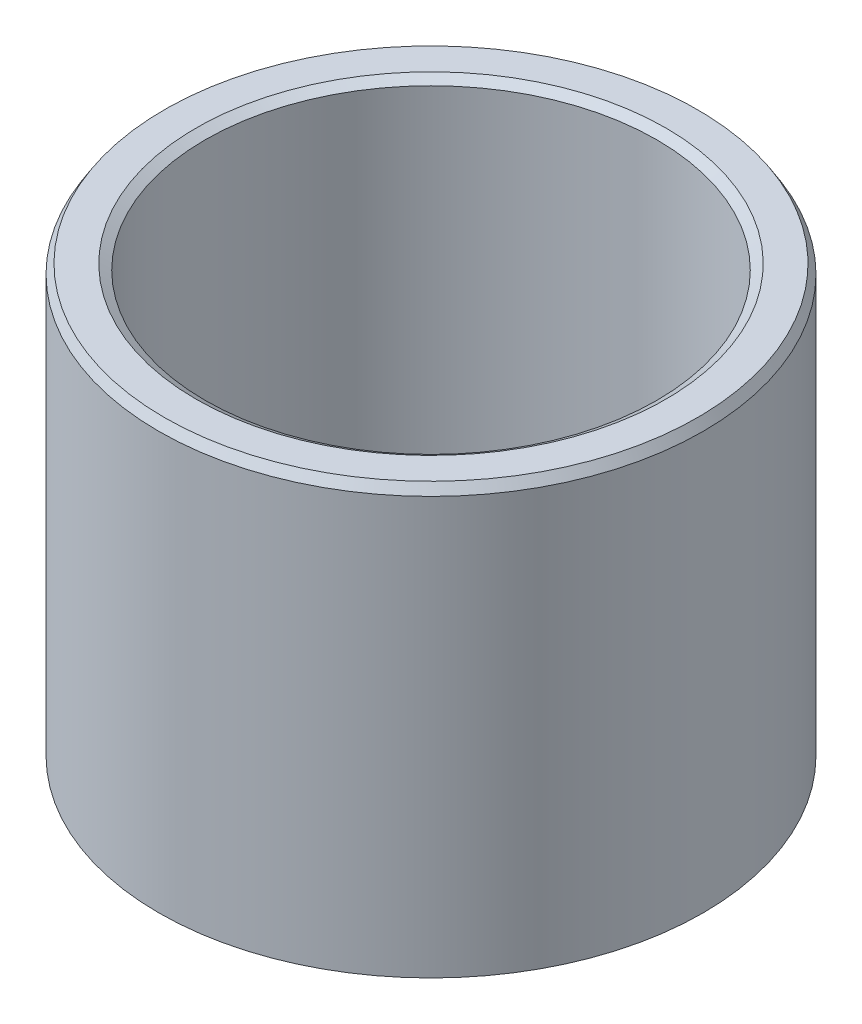
ISO-10303-21;
HEADER;
FILE_DESCRIPTION(('STEP AP214'),'2;1');
FILE_NAME('part.step','',(''),(''),'','','');
FILE_SCHEMA(('AUTOMOTIVE_DESIGN { 1 0 10303 214 1 1 1 1 }'));
ENDSEC;
DATA;
#1=APPLICATION_CONTEXT('core data for automotive mechanical design processes');
#2=APPLICATION_PROTOCOL_DEFINITION('international standard','automotive_design',2000,#1);
#3=PRODUCT_CONTEXT('',#1,'mechanical');
#4=PRODUCT('Part','Part','',(#3));
#5=PRODUCT_RELATED_PRODUCT_CATEGORY('part','',(#4));
#6=PRODUCT_DEFINITION_FORMATION('','',#4);
#7=PRODUCT_DEFINITION_CONTEXT('part definition',#1,'design');
#8=PRODUCT_DEFINITION('design','',#6,#7);
#9=PRODUCT_DEFINITION_SHAPE('','',#8);
#10=(LENGTH_UNIT() NAMED_UNIT(*) SI_UNIT(.MILLI.,.METRE.));
#11=(NAMED_UNIT(*) PLANE_ANGLE_UNIT() SI_UNIT($,.RADIAN.));
#12=(NAMED_UNIT(*) SI_UNIT($,.STERADIAN.) SOLID_ANGLE_UNIT());
#13=UNCERTAINTY_MEASURE_WITH_UNIT(LENGTH_MEASURE(1.E-05),#10,'distance_accuracy_value','');
#14=(GEOMETRIC_REPRESENTATION_CONTEXT(3) GLOBAL_UNCERTAINTY_ASSIGNED_CONTEXT((#13)) GLOBAL_UNIT_ASSIGNED_CONTEXT((#10,
#11,#12)) REPRESENTATION_CONTEXT('',''));
#15=CARTESIAN_POINT('',(0.,0.,0.));
#16=DIRECTION('',(0.,0.,1.));
#17=DIRECTION('',(1.,0.,0.));
#18=AXIS2_PLACEMENT_3D('',#15,#16,#17);
#19=CARTESIAN_POINT('',(0.,47.5842711283165,0.));
#20=DIRECTION('',(0.,-1.,0.));
#21=DIRECTION('',(0.,0.,-1.));
#22=AXIS2_PLACEMENT_3D('',#19,#20,#21);
#23=CYLINDRICAL_SURFACE('',#22,30.);
#24=CARTESIAN_POINT('',(0.,0.618793119774128,0.));
#25=DIRECTION('',(0.,1.,0.));
#26=DIRECTION('',(0.,0.,1.));
#27=AXIS2_PLACEMENT_3D('',#24,#25,#26);
#28=CIRCLE('',#27,30.);
#29=CARTESIAN_POINT('',(0.,0.618793119774128,30.));
#30=VERTEX_POINT('',#29);
#31=EDGE_CURVE('E10',#30,#30,#28,.T.);
#32=ORIENTED_EDGE('',*,*,#31,.T.);
#33=EDGE_LOOP('',(#32));
#34=FACE_BOUND('',#33,.T.);
#35=CARTESIAN_POINT('',(0.,46.57749135171,0.));
#36=DIRECTION('',(0.,1.,0.));
#37=DIRECTION('',(0.,0.,1.));
#38=AXIS2_PLACEMENT_3D('',#35,#36,#37);
#39=CIRCLE('',#38,30.);
#40=CARTESIAN_POINT('',(0.,46.57749135171,30.));
#41=VERTEX_POINT('',#40);
#42=EDGE_CURVE('E50',#41,#41,#39,.F.);
#43=ORIENTED_EDGE('',*,*,#42,.T.);
#44=EDGE_LOOP('',(#43));
#45=FACE_BOUND('',#44,.T.);
#46=ADVANCED_FACE('F39',(#34,#45),#23,.T.);
#47=CARTESIAN_POINT('',(0.,47.5842711283165,0.));
#48=DIRECTION('',(0.,1.,0.));
#49=DIRECTION('',(0.,0.,1.));
#50=AXIS2_PLACEMENT_3D('',#47,#48,#49);
#51=PLANE('',#50);
#52=CARTESIAN_POINT('',(0.,47.5842711283165,0.));
#53=DIRECTION('',(0.,1.,0.));
#54=DIRECTION('',(0.,0.,1.));
#55=AXIS2_PLACEMENT_3D('',#52,#53,#54);
#56=CIRCLE('',#55,25.8882689231475);
#57=CARTESIAN_POINT('',(0.,47.5842711283165,25.8882689231475));
#58=VERTEX_POINT('',#57);
#59=EDGE_CURVE('E58',#58,#58,#56,.F.);
#60=ORIENTED_EDGE('',*,*,#59,.T.);
#61=EDGE_LOOP('',(#60));
#62=FACE_BOUND('',#61,.T.);
#63=CARTESIAN_POINT('',(0.,47.5842711283165,0.));
#64=DIRECTION('',(0.,1.,0.));
#65=DIRECTION('',(0.,0.,1.));
#66=AXIS2_PLACEMENT_3D('',#63,#64,#65);
#67=CIRCLE('',#66,29.3812068802259);
#68=CARTESIAN_POINT('',(0.,47.5842711283165,29.3812068802259));
#69=VERTEX_POINT('',#68);
#70=EDGE_CURVE('E61',#69,#69,#67,.T.);
#71=ORIENTED_EDGE('',*,*,#70,.T.);
#72=EDGE_LOOP('',(#71));
#73=FACE_BOUND('',#72,.T.);
#74=ADVANCED_FACE('F88',(#62,#73),#51,.T.);
#75=CARTESIAN_POINT('',(0.,0.,0.));
#76=DIRECTION('',(0.,1.,0.));
#77=DIRECTION('',(0.,0.,1.));
#78=AXIS2_PLACEMENT_3D('',#75,#76,#77);
#79=PLANE('',#78);
#80=CARTESIAN_POINT('',(0.,0.,0.));
#81=DIRECTION('',(0.,1.,0.));
#82=DIRECTION('',(0.,0.,1.));
#83=AXIS2_PLACEMENT_3D('',#80,#81,#82);
#84=CIRCLE('',#83,25.5002822663151);
#85=CARTESIAN_POINT('',(0.,0.,25.5002822663151));
#86=VERTEX_POINT('',#85);
#87=EDGE_CURVE('E51',#86,#86,#84,.T.);
#88=ORIENTED_EDGE('',*,*,#87,.T.);
#89=EDGE_LOOP('',(#88));
#90=FACE_BOUND('',#89,.T.);
#91=CARTESIAN_POINT('',(0.,0.,0.));
#92=DIRECTION('',(0.,1.,0.));
#93=DIRECTION('',(0.,0.,1.));
#94=AXIS2_PLACEMENT_3D('',#91,#92,#93);
#95=CIRCLE('',#94,28.9932202233935);
#96=CARTESIAN_POINT('',(0.,0.,28.9932202233935));
#97=VERTEX_POINT('',#96);
#98=EDGE_CURVE('E54',#97,#97,#95,.F.);
#99=ORIENTED_EDGE('',*,*,#98,.T.);
#100=EDGE_LOOP('',(#99));
#101=FACE_BOUND('',#100,.T.);
#102=ADVANCED_FACE('F83',(#90,#101),#79,.F.);
#103=CARTESIAN_POINT('',(0.,47.5842711283165,0.));
#104=DIRECTION('',(0.,-1.,0.));
#105=DIRECTION('',(0.,0.,-1.));
#106=AXIS2_PLACEMENT_3D('',#103,#104,#105);
#107=CYLINDRICAL_SURFACE('',#106,24.881489146541);
#108=CARTESIAN_POINT('',(0.,46.9654780085424,0.));
#109=DIRECTION('',(0.,1.,0.));
#110=DIRECTION('',(0.,0.,1.));
#111=AXIS2_PLACEMENT_3D('',#108,#109,#110);
#112=CIRCLE('',#111,24.881489146541);
#113=CARTESIAN_POINT('',(0.,46.9654780085424,24.881489146541));
#114=VERTEX_POINT('',#113);
#115=EDGE_CURVE('E67',#114,#114,#112,.T.);
#116=ORIENTED_EDGE('',*,*,#115,.T.);
#117=EDGE_LOOP('',(#116));
#118=FACE_BOUND('',#117,.T.);
#119=CARTESIAN_POINT('',(0.,1.00677977660647,0.));
#120=DIRECTION('',(0.,1.,0.));
#121=DIRECTION('',(0.,0.,1.));
#122=AXIS2_PLACEMENT_3D('',#119,#120,#121);
#123=CIRCLE('',#122,24.881489146541);
#124=CARTESIAN_POINT('',(0.,1.00677977660647,24.881489146541));
#125=VERTEX_POINT('',#124);
#126=EDGE_CURVE('E69',#125,#125,#123,.F.);
#127=ORIENTED_EDGE('',*,*,#126,.T.);
#128=EDGE_LOOP('',(#127));
#129=FACE_BOUND('',#128,.T.);
#130=ADVANCED_FACE('F71',(#118,#129),#107,.F.);
#131=CARTESIAN_POINT('',(0.,46.9654780085424,0.));
#132=DIRECTION('',(0.,1.,0.));
#133=DIRECTION('',(0.,0.,1.));
#134=AXIS2_PLACEMENT_3D('',#131,#132,#133);
#135=CONICAL_SURFACE('',#134,24.881489146541,1.01969170403365);
#136=ORIENTED_EDGE('',*,*,#59,.F.);
#137=EDGE_LOOP('',(#136));
#138=FACE_BOUND('',#137,.T.);
#139=ORIENTED_EDGE('',*,*,#115,.F.);
#140=EDGE_LOOP('',(#139));
#141=FACE_BOUND('',#140,.T.);
#142=ADVANCED_FACE('F77',(#138,#141),#135,.F.);
#143=CARTESIAN_POINT('',(0.,0.,0.));
#144=DIRECTION('',(0.,-1.,0.));
#145=DIRECTION('',(0.,0.,-1.));
#146=AXIS2_PLACEMENT_3D('',#143,#144,#145);
#147=CONICAL_SURFACE('',#146,25.5002822663151,0.551104622761244);
#148=ORIENTED_EDGE('',*,*,#126,.F.);
#149=EDGE_LOOP('',(#148));
#150=FACE_BOUND('',#149,.T.);
#151=ORIENTED_EDGE('',*,*,#87,.F.);
#152=EDGE_LOOP('',(#151));
#153=FACE_BOUND('',#152,.T.);
#154=ADVANCED_FACE('F73',(#150,#153),#147,.F.);
#155=CARTESIAN_POINT('',(0.,0.618793119774128,0.));
#156=DIRECTION('',(0.,1.,0.));
#157=DIRECTION('',(0.,0.,1.));
#158=AXIS2_PLACEMENT_3D('',#155,#156,#157);
#159=CONICAL_SURFACE('',#158,30.,1.01969170403364);
#160=ORIENTED_EDGE('',*,*,#98,.F.);
#161=EDGE_LOOP('',(#160));
#162=FACE_BOUND('',#161,.T.);
#163=ORIENTED_EDGE('',*,*,#31,.F.);
#164=EDGE_LOOP('',(#163));
#165=FACE_BOUND('',#164,.T.);
#166=ADVANCED_FACE('F76',(#162,#165),#159,.T.);
#167=CARTESIAN_POINT('',(0.,47.5842711283165,0.));
#168=DIRECTION('',(0.,-1.,0.));
#169=DIRECTION('',(0.,0.,-1.));
#170=AXIS2_PLACEMENT_3D('',#167,#168,#169);
#171=CONICAL_SURFACE('',#170,29.3812068802259,0.551104622761247);
#172=ORIENTED_EDGE('',*,*,#42,.F.);
#173=EDGE_LOOP('',(#172));
#174=FACE_BOUND('',#173,.T.);
#175=ORIENTED_EDGE('',*,*,#70,.F.);
#176=EDGE_LOOP('',(#175));
#177=FACE_BOUND('',#176,.T.);
#178=ADVANCED_FACE('F45',(#174,#177),#171,.T.);
#179=CLOSED_SHELL('',(#46,#74,#102,#130,#142,#154,#166,#178));
#180=MANIFOLD_SOLID_BREP('B2',#179);
#181=ADVANCED_BREP_SHAPE_REPRESENTATION('',(#18,#180),#14);
#182=SHAPE_DEFINITION_REPRESENTATION(#9,#181);
ENDSEC;
END-ISO-10303-21;
